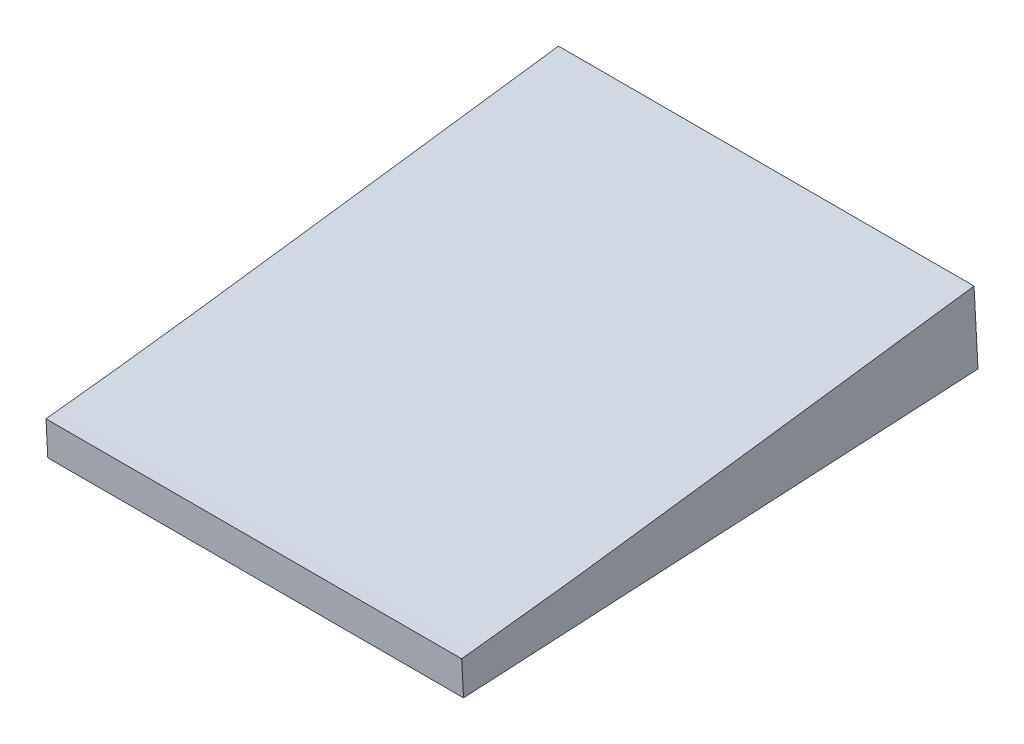
ISO-10303-21;
HEADER;
FILE_DESCRIPTION(('STEP AP214'),'2;1');
FILE_NAME('part.step','',(''),(''),'','','');
FILE_SCHEMA(('AUTOMOTIVE_DESIGN { 1 0 10303 214 1 1 1 1 }'));
ENDSEC;
DATA;
#1=APPLICATION_CONTEXT('core data for automotive mechanical design processes');
#2=APPLICATION_PROTOCOL_DEFINITION('international standard','automotive_design',2000,#1);
#3=PRODUCT_CONTEXT('',#1,'mechanical');
#4=PRODUCT('Part','Part','',(#3));
#5=PRODUCT_RELATED_PRODUCT_CATEGORY('part','',(#4));
#6=PRODUCT_DEFINITION_FORMATION('','',#4);
#7=PRODUCT_DEFINITION_CONTEXT('part definition',#1,'design');
#8=PRODUCT_DEFINITION('design','',#6,#7);
#9=PRODUCT_DEFINITION_SHAPE('','',#8);
#10=(LENGTH_UNIT() NAMED_UNIT(*) SI_UNIT(.MILLI.,.METRE.));
#11=(NAMED_UNIT(*) PLANE_ANGLE_UNIT() SI_UNIT($,.RADIAN.));
#12=(NAMED_UNIT(*) SI_UNIT($,.STERADIAN.) SOLID_ANGLE_UNIT());
#13=UNCERTAINTY_MEASURE_WITH_UNIT(LENGTH_MEASURE(1.E-05),#10,'distance_accuracy_value','');
#14=(GEOMETRIC_REPRESENTATION_CONTEXT(3) GLOBAL_UNCERTAINTY_ASSIGNED_CONTEXT((#13)) GLOBAL_UNIT_ASSIGNED_CONTEXT((#10,
#11,#12)) REPRESENTATION_CONTEXT('',''));
#15=CARTESIAN_POINT('',(0.,0.,0.));
#16=DIRECTION('',(0.,0.,1.));
#17=DIRECTION('',(1.,0.,0.));
#18=AXIS2_PLACEMENT_3D('',#15,#16,#17);
#19=CARTESIAN_POINT('',(-177.805848873745,-43.688210722732,-115.550179040921));
#20=DIRECTION('',(-2.29475219963646E-07,0.0534934907984705,-0.998568198192863));
#21=DIRECTION('',(0.,0.99856819819289,0.053493490798472));
#22=AXIS2_PLACEMENT_3D('',#19,#20,#21);
#23=PLANE('',#22);
#24=CARTESIAN_POINT('',(-339.424320676004,-41.2286300415403,-115.418381689263));
#25=CARTESIAN_POINT('',(-312.486933896687,-41.2286599807383,-115.418389483438));
#26=CARTESIAN_POINT('',(-285.549547117365,-41.2286808422066,-115.418396791316));
#27=CARTESIAN_POINT('',(-231.674773558697,-41.2287044096837,-115.418410434483));
#28=CARTESIAN_POINT('',(-204.737386779351,-41.2287071156926,-115.41841676977));
#29=CARTESIAN_POINT('',(-177.8,-41.2287007439717,-115.418422618762));
#30=B_SPLINE_CURVE_WITH_KNOTS('',3,(#24,#25,#26,#27,#28,#29),.UNSPECIFIED.,.F.,.F.,(4,2,4),(0.,
80.8121603379917,161.624320676034),.UNSPECIFIED.);
#31=CARTESIAN_POINT('',(-338.453291853417,-41.2286313501884,-115.418381982514));
#32=VERTEX_POINT('',#31);
#33=CARTESIAN_POINT('',(-177.8,-41.2287007439717,-115.418422618762));
#34=VERTEX_POINT('',#33);
#35=EDGE_CURVE('E99',#32,#34,#30,.T.);
#36=ORIENTED_EDGE('',*,*,#35,.T.);
#37=DIRECTION('',(0.,-0.99856819819289,-0.053493490798472));
#38=VECTOR('',#37,1.);
#39=CARTESIAN_POINT('',(-177.8,6.04731605634461,-112.885837288814));
#40=LINE('',#39,#38);
#41=CARTESIAN_POINT('',(-177.8,-27.7854361643582,-114.698264347082));
#42=VERTEX_POINT('',#41);
#43=EDGE_CURVE('E102',#42,#34,#40,.T.);
#44=ORIENTED_EDGE('',*,*,#43,.F.);
#45=CARTESIAN_POINT('',(-177.8,-27.7854361642381,-114.698264347069));
#46=CARTESIAN_POINT('',(-231.674773558668,-27.7854374698395,-114.698252035584));
#47=CARTESIAN_POINT('',(-285.549547117336,-27.7854387754408,-114.698239724099));
#48=CARTESIAN_POINT('',(-339.424320676004,-27.7854400810422,-114.698227412614));
#49=B_SPLINE_CURVE_WITH_KNOTS('',3,(#45,#46,#47,#48),.UNSPECIFIED.,.F.,.F.,(4,4),(0.,
161.624320676009),.UNSPECIFIED.);
#50=CARTESIAN_POINT('',(-338.421323075372,-27.7854400567378,-114.698227641805));
#51=VERTEX_POINT('',#50);
#52=EDGE_CURVE('E47',#42,#51,#49,.T.);
#53=ORIENTED_EDGE('',*,*,#52,.T.);
#54=DIRECTION('',(0.0023746530409731,0.998565382766486,0.0534933394298316));
#55=VECTOR('',#54,1.);
#56=CARTESIAN_POINT('',(-338.458234976646,-43.3072641668652,-115.529734741914));
#57=LINE('',#56,#55);
#58=EDGE_CURVE('E11',#32,#51,#57,.T.);
#59=ORIENTED_EDGE('',*,*,#58,.F.);
#60=EDGE_LOOP('',(#36,#44,#53,#59));
#61=FACE_BOUND('',#60,.T.);
#62=ADVANCED_FACE('F42',(#61),#23,.F.);
#63=CARTESIAN_POINT('',(-177.805940246243,-33.0381702413849,-314.355519034823));
#64=DIRECTION('',(-2.29475219526301E-07,0.0534934907984705,-0.998568198192863));
#65=DIRECTION('',(0.,0.99856819819289,0.053493490798472));
#66=AXIS2_PLACEMENT_3D('',#63,#64,#65);
#67=PLANE('',#66);
#68=CARTESIAN_POINT('',(-339.4243660882,-30.5401987010888,-314.221665077456));
#69=CARTESIAN_POINT('',(-312.486971740172,-30.5402152320651,-314.221672153351));
#70=CARTESIAN_POINT('',(-285.549577392142,-30.5402267068268,-314.221678958384));
#71=CARTESIAN_POINT('',(-231.674788696076,-30.540239543921,-314.221692026726));
#72=CARTESIAN_POINT('',(-204.737394348038,-30.5402409062534,-314.221698290034));
#73=CARTESIAN_POINT('',(-177.8,-30.5402372123712,-314.22170428248));
#74=B_SPLINE_CURVE_WITH_KNOTS('',3,(#68,#69,#70,#71,#72,#73),.UNSPECIFIED.,.F.,.F.,(4,2,4),(0.,
80.8121830440984,161.624366088212),.UNSPECIFIED.);
#75=CARTESIAN_POINT('',(-338.453246242115,-30.5401994156522,-314.221665338883));
#76=VERTEX_POINT('',#75);
#77=CARTESIAN_POINT('',(-177.8,-30.5402372123712,-314.22170428248));
#78=VERTEX_POINT('',#77);
#79=EDGE_CURVE('E74',#76,#78,#74,.T.);
#80=ORIENTED_EDGE('',*,*,#79,.F.);
#81=DIRECTION('',(0.0023746530409731,0.998565382766486,0.0534933394298316));
#82=VECTOR('',#81,1.);
#83=CARTESIAN_POINT('',(-338.458280662959,-32.6572237938514,-314.335074741631));
#84=LINE('',#83,#82);
#85=CARTESIAN_POINT('',(-338.385473794122,-2.04120638245379,-312.694968806027));
#86=VERTEX_POINT('',#85);
#87=EDGE_CURVE('E100',#76,#86,#84,.T.);
#88=ORIENTED_EDGE('',*,*,#87,.T.);
#89=CARTESIAN_POINT('',(-177.8,-2.04120156395444,-312.695005454346));
#90=CARTESIAN_POINT('',(-231.674788696067,-2.041203180511,-312.694993159211));
#91=CARTESIAN_POINT('',(-285.549577392133,-2.04120479706756,-312.694980864076));
#92=CARTESIAN_POINT('',(-339.4243660882,-2.04120641362412,-312.694968568941));
#93=B_SPLINE_CURVE_WITH_KNOTS('',3,(#89,#90,#91,#92),.UNSPECIFIED.,.F.,.F.,(4,4),(0.,
161.624366088204),.UNSPECIFIED.);
#94=CARTESIAN_POINT('',(-177.8,-2.0412015642015,-312.695005454378));
#95=VERTEX_POINT('',#94);
#96=EDGE_CURVE('E66',#95,#86,#93,.T.);
#97=ORIENTED_EDGE('',*,*,#96,.F.);
#98=DIRECTION('',(0.,-0.99856819819289,-0.053493490798472));
#99=VECTOR('',#98,1.);
#100=CARTESIAN_POINT('',(-177.8,16.697356429359,-311.691177288541));
#101=LINE('',#100,#99);
#102=EDGE_CURVE('E107',#95,#78,#101,.T.);
#103=ORIENTED_EDGE('',*,*,#102,.T.);
#104=EDGE_LOOP('',(#80,#88,#97,#103));
#105=FACE_BOUND('',#104,.T.);
#106=ADVANCED_FACE('F157',(#105),#67,.T.);
#107=CARTESIAN_POINT('',(-338.458280662959,-32.6572237938514,-314.335074741631));
#108=DIRECTION('',(-0.999997180507466,0.0023712407330619,0.000127257626607295));
#109=DIRECTION('',(-0.00237124075226243,-0.999997188604695,0.));
#110=AXIS2_PLACEMENT_3D('',#107,#108,#109);
#111=PLANE('',#110);
#112=CARTESIAN_POINT('',(-338.453292687718,-41.4241402998049,-111.781943848078));
#113=CARTESIAN_POINT('',(-338.453277104788,-37.7724773870629,-179.70234426699));
#114=CARTESIAN_POINT('',(-338.453261521857,-34.1208144743209,-247.622744685901));
#115=CARTESIAN_POINT('',(-338.453245938927,-30.469151561579,-315.543145104813));
#116=B_SPLINE_CURVE_WITH_KNOTS('',3,(#112,#113,#114,#115),.UNSPECIFIED.,.F.,.F.,(4,4),(0.,
204.055479994644),.UNSPECIFIED.);
#117=EDGE_CURVE('E106',#32,#76,#116,.T.);
#118=ORIENTED_EDGE('',*,*,#117,.F.);
#119=ORIENTED_EDGE('',*,*,#58,.T.);
#120=CARTESIAN_POINT('',(-338.384947441491,-1.66638011947957,-315.543145104813));
#121=CARTESIAN_POINT('',(-338.385078563461,-1.75963757033328,-314.835806230373));
#122=CARTESIAN_POINT('',(-338.385209250782,-1.85271300648972,-314.128443420129));
#123=CARTESIAN_POINT('',(-338.385470367223,-2.03875575841565,-312.713703481737));
#124=CARTESIAN_POINT('',(-338.385600796342,-2.13172307417116,-312.006326353586));
#125=CARTESIAN_POINT('',(-338.385862007422,-2.3178054581883,-310.591591608237));
#126=CARTESIAN_POINT('',(-338.385992789381,-2.41092052643067,-309.884233991036));
#127=CARTESIAN_POINT('',(-338.386255215013,-2.59751150681119,-308.469566388183));
#128=CARTESIAN_POINT('',(-338.386386858684,-2.69098741892434,-307.762256402527));
#129=CARTESIAN_POINT('',(-338.386650876671,-2.87824516985871,-306.347677416689));
#130=CARTESIAN_POINT('',(-338.386783250986,-2.97202700847756,-305.64040841648));
#131=CARTESIAN_POINT('',(-338.387048665371,-3.15986946259663,-304.225907407066));
#132=CARTESIAN_POINT('',(-338.387181705442,-3.25393007810986,-303.518675397862));
#133=CARTESIAN_POINT('',(-338.387581697856,-3.53647713634071,-301.39702803848));
#134=CARTESIAN_POINT('',(-338.387849522406,-3.7253287950901,-299.982661323765));
#135=CARTESIAN_POINT('',(-338.388386881024,-4.1037469056632,-297.15404237198));
#136=CARTESIAN_POINT('',(-338.388656415071,-4.29331334812752,-295.739790133656));
#137=CARTESIAN_POINT('',(-338.389196491617,-4.67286847586112,-292.911342318118));
#138=CARTESIAN_POINT('',(-338.389467034116,-4.86285716113694,-291.497146740906));
#139=CARTESIAN_POINT('',(-338.390008809956,-5.2431238029318,-288.668794146179));
#140=CARTESIAN_POINT('',(-338.390280043296,-5.43340175951744,-287.254637128672));
#141=CARTESIAN_POINT('',(-338.390823344902,-5.8143072482647,-284.42637019891));
#142=CARTESIAN_POINT('',(-338.391095413167,-6.00493478042056,-283.012260286654));
#143=CARTESIAN_POINT('',(-338.391912979578,-6.5773859396157,-278.770035957681));
#144=CARTESIAN_POINT('',(-338.392459844743,-6.95978192100255,-275.94199873558));
#145=CARTESIAN_POINT('',(-338.393557593861,-7.72625642597304,-270.286152693634));
#146=CARTESIAN_POINT('',(-338.394108477815,-8.11033494936245,-267.458343873762));
#147=CARTESIAN_POINT('',(-338.395212992249,-8.87964046162332,-261.802908783977));
#148=CARTESIAN_POINT('',(-338.395766622704,-9.26486743999917,-258.975282512637));
#149=CARTESIAN_POINT('',(-338.39687553348,-10.0360121279861,-253.320124034228));
#150=CARTESIAN_POINT('',(-338.3974308138,-10.4219298376351,-250.492591827166));
#151=CARTESIAN_POINT('',(-338.398541874375,-11.1939730891917,-244.837583301825));
#152=CARTESIAN_POINT('',(-338.399097654625,-11.5800986290797,-242.010106983271));
#153=CARTESIAN_POINT('',(-338.400208582343,-12.3520847920908,-236.355118210172));
#154=CARTESIAN_POINT('',(-338.400763729811,-12.7379454152181,-233.527605755627));
#155=CARTESIAN_POINT('',(-338.401872048431,-13.5088376956471,-227.872497300756));
#156=CARTESIAN_POINT('',(-338.402425219605,-13.8938693614024,-225.044901301582));
#157=CARTESIAN_POINT('',(-338.403528262364,-14.6625512779186,-219.389521413539));
#158=CARTESIAN_POINT('',(-338.40407813395,-15.0462015286648,-216.561737524667));
#159=CARTESIAN_POINT('',(-338.405173264434,-15.8115786127917,-210.905762784127));
#160=CARTESIAN_POINT('',(-338.405718523096,-16.1933053472859,-208.07757191907));
#161=CARTESIAN_POINT('',(-338.406803097703,-16.9542706341982,-202.420855270575));
#162=CARTESIAN_POINT('',(-338.407342413649,-17.3335091866207,-199.592329487137));
#163=CARTESIAN_POINT('',(-338.40841320511,-18.0887016821352,-193.934870804958));
#164=CARTESIAN_POINT('',(-338.408944680712,-18.4646556612982,-191.105937911034));
#165=CARTESIAN_POINT('',(-338.409997858857,-19.2124711879498,-185.447530776499));
#166=CARTESIAN_POINT('',(-338.410519561399,-19.5843327353214,-182.618056535871));
#167=CARTESIAN_POINT('',(-338.411551240678,-20.3231435784671,-176.958497932764));
#168=CARTESIAN_POINT('',(-338.412061217543,-20.6900929281017,-174.128413577322));
#169=CARTESIAN_POINT('',(-338.413067582981,-21.4183004966397,-168.467512402178));
#170=CARTESIAN_POINT('',(-338.413563971555,-21.7795587160408,-165.63669558254));
#171=CARTESIAN_POINT('',(-338.414540658199,-22.4953353830681,-159.974206673273));
#172=CARTESIAN_POINT('',(-338.415020956253,-22.8498538250268,-157.142534582927));
#173=CARTESIAN_POINT('',(-338.415962801398,-23.5510353741845,-151.478215826155));
#174=CARTESIAN_POINT('',(-338.416424348481,-23.8976984783174,-148.64556915935));
#175=CARTESIAN_POINT('',(-338.417326052974,-24.5820676026304,-142.979095470675));
#176=CARTESIAN_POINT('',(-338.41776620966,-24.9197733189908,-140.145268412069));
#177=CARTESIAN_POINT('',(-338.41862258255,-25.585151645236,-134.476439483816));
#178=CARTESIAN_POINT('',(-338.419038798787,-25.912824269082,-131.641437615807));
#179=CARTESIAN_POINT('',(-338.419844049086,-26.5567906864522,-125.969861066777));
#180=CARTESIAN_POINT('',(-338.420233080515,-26.8730833761396,-123.133286260133));
#181=CARTESIAN_POINT('',(-338.420980269604,-27.4927252701061,-117.458709927419));
#182=CARTESIAN_POINT('',(-338.421338427109,-27.7960744089563,-114.62070839421));
#183=CARTESIAN_POINT('',(-338.421679321969,-28.0921845117294,-111.781943848078));
#184=B_SPLINE_CURVE_WITH_KNOTS('',3,(#120,#121,#122,#123,#124,#125,#126,#127,#128,#129,#130,
#131,#132,#133,#134,#135,#136,#137,#138,#139,#140,#141,#142,#143,#144,#145,#146,#147,#148,#149,
#150,#151,#152,#153,#154,#155,#156,#157,#158,#159,#160,#161,#162,#163,#164,#165,#166,#167,#168,
#169,#170,#171,#172,#173,#174,#175,#176,#177,#178,#179,#180,#181,#182,#183),.UNSPECIFIED.,.F.,
.F.,(4,2,2,2,2,2,2,2,2,2,2,2,2,2,2,2,2,2,2,2,2,2,2,2,2,2,2,2,2,2,2,4),(0.,2.14038007487454,
4.28076042653164,6.42114049919354,8.5615204235638,10.7018989323324,12.8422775410499,
17.1230346593276,21.4037359186347,25.6844372442147,29.9651395555147,34.2458417963986,
42.8071608777192,51.3684789707217,59.9297190610428,68.4909596218779,77.0521184405876,
85.613277119377,94.1743480743276,102.73541911965,111.296925882802,119.858432631171,
128.419845239388,136.981258092505,145.542576995954,154.103895150897,162.665220504814,
171.226549200314,179.788167911635,188.349774708823,196.91220974255,205.474688053845),.UNSPECIFIED.);
#185=EDGE_CURVE('E97',#86,#51,#184,.T.);
#186=ORIENTED_EDGE('',*,*,#185,.F.);
#187=ORIENTED_EDGE('',*,*,#87,.F.);
#188=EDGE_LOOP('',(#118,#119,#186,#187));
#189=FACE_BOUND('',#188,.T.);
#190=ADVANCED_FACE('F44',(#189),#111,.T.);
#191=CARTESIAN_POINT('',(-177.8,0.,0.));
#192=DIRECTION('',(-1.,0.,0.));
#193=DIRECTION('',(0.,0.,1.));
#194=AXIS2_PLACEMENT_3D('',#191,#192,#193);
#195=PLANE('',#194);
#196=CARTESIAN_POINT('',(-177.8,-6.51913907058263,69.5663617744474));
#197=CARTESIAN_POINT('',(-177.8,-6.88721273253516,69.4883910827677));
#198=CARTESIAN_POINT('',(-177.8,-7.61052758633523,69.3363760132391));
#199=CARTESIAN_POINT('',(-177.8,-8.76184326811464,69.0354225894495));
#200=CARTESIAN_POINT('',(-177.8,-9.88259406782119,68.626070203946));
#201=CARTESIAN_POINT('',(-177.8,-12.021228930256,67.6619851025588));
#202=CARTESIAN_POINT('',(-177.8,-14.9546020256939,65.6923130131807));
#203=CARTESIAN_POINT('',(-177.8,-18.1374494761777,62.3412188200519));
#204=CARTESIAN_POINT('',(-177.8,-21.5964876349103,57.3382189268778));
#205=CARTESIAN_POINT('',(-177.8,-24.7903629698325,50.5220499235312));
#206=CARTESIAN_POINT('',(-177.8,-27.5359775514862,42.0059138994073));
#207=CARTESIAN_POINT('',(-177.8,-29.5513425657538,33.3240400078997));
#208=CARTESIAN_POINT('',(-177.8,-31.532992144648,21.6352015564033));
#209=CARTESIAN_POINT('',(-177.8,-33.0186008410447,6.91344102508237));
#210=CARTESIAN_POINT('',(-177.8,-33.7765423596692,-10.7972873340441));
#211=CARTESIAN_POINT('',(-177.8,-33.7950491418743,-28.5097311954228));
#212=CARTESIAN_POINT('',(-177.8,-33.2586088383385,-46.2043865238911));
#213=CARTESIAN_POINT('',(-177.8,-31.9669194489648,-69.7641945581866));
#214=CARTESIAN_POINT('',(-177.8,-29.5034076215053,-99.1460197389462));
#215=CARTESIAN_POINT('',(-177.8,-25.6933715620582,-134.308212307564));
#216=CARTESIAN_POINT('',(-177.8,-21.3490549530988,-169.399514794737));
#217=CARTESIAN_POINT('',(-177.8,-16.7038848255612,-204.446464420127));
#218=CARTESIAN_POINT('',(-177.8,-11.9288122826792,-239.471434511741));
#219=CARTESIAN_POINT('',(-177.8,-7.93942067939684,-268.654643904962));
#220=CARTESIAN_POINT('',(-177.8,-4.79172290140647,-292.007732636027));
#221=CARTESIAN_POINT('',(-177.8,-2.83780100098235,-306.600292672818));
#222=CARTESIAN_POINT('',(-177.8,-1.30907436693598,-318.288997719976));
#223=CARTESIAN_POINT('',(-177.8,0.263068831943658,-329.949567815073));
#224=CARTESIAN_POINT('',(-177.8,1.719295513011,-344.570295270056));
#225=CARTESIAN_POINT('',(-177.8,2.80506666571039,-362.175990442094));
#226=CARTESIAN_POINT('',(-177.8,3.31793184017618,-385.687405296962));
#227=CARTESIAN_POINT('',(-177.8,2.25388387982141,-415.082460117617));
#228=CARTESIAN_POINT('',(-177.8,-0.960221939673565,-444.321872591633));
#229=CARTESIAN_POINT('',(-177.8,-4.72777257870521,-467.542126740326));
#230=CARTESIAN_POINT('',(-177.8,-6.96557190432381,-479.089279042028));
#231=CARTESIAN_POINT('',(-177.8,-8.1921973731203,-484.839703055914));
#232=B_SPLINE_CURVE_WITH_KNOTS('',3,(#196,#197,#198,#199,#200,#201,#202,#203,#204,#205,#206,
#207,#208,#209,#210,#211,#212,#213,#214,#215,#216,#217,#218,#219,#220,#221,#222,#223,#224,#225,
#226,#227,#228,#229,#230,#231),.UNSPECIFIED.,.F.,.F.,(4,1,1,1,1,1,1,1,1,1,1,1,1,1,1,1,1,1,1,1,1,
1,1,1,1,1,1,1,1,1,1,1,1,4),(-6.87555594952044E-05,0.00188450372870693,0.00383776301690907,
0.00579102230511121,0.00774428159331335,0.0155573187461219,0.0233703558989304,0.031183393051739,
0.0468094673573561,0.0624355416629732,0.0780616159685904,0.0936876902742075,0.124939838885442,
0.156191987496676,0.18744413610791,0.218696284719144,0.249948433330378,0.312452730552847,
0.374957027775315,0.437461324997784,0.499965622220252,0.562469919442721,0.624974216665189,
0.656226365276424,0.687478513887658,0.703104588193275,0.718730662498892,0.749982811110126,
0.78123495972136,0.812487108332595,0.874991405555063,0.937495702777532,0.968747851388766,1.),.UNSPECIFIED.);
#233=EDGE_CURVE('E58',#42,#95,#232,.T.);
#234=ORIENTED_EDGE('',*,*,#233,.F.);
#235=ORIENTED_EDGE('',*,*,#43,.T.);
#236=DIRECTION('',(0.,-0.0536864833252265,0.998557840842567));
#237=VECTOR('',#236,1.);
#238=CARTESIAN_POINT('',(-177.8,-19.8517756392125,-513.024949519574));
#239=LINE('',#238,#237);
#240=EDGE_CURVE('E111',#78,#34,#239,.T.);
#241=ORIENTED_EDGE('',*,*,#240,.F.);
#242=ORIENTED_EDGE('',*,*,#102,.F.);
#243=EDGE_LOOP('',(#234,#235,#241,#242));
#244=FACE_BOUND('',#243,.T.);
#245=ADVANCED_FACE('F109',(#244),#195,.F.);
#246=DIRECTION('',(-1.,0.,0.));
#247=VECTOR('',#246,1.);
#248=SURFACE_OF_LINEAR_EXTRUSION('',#232,#247);
#249=ORIENTED_EDGE('',*,*,#96,.T.);
#250=ORIENTED_EDGE('',*,*,#185,.T.);
#251=ORIENTED_EDGE('',*,*,#52,.F.);
#252=ORIENTED_EDGE('',*,*,#233,.T.);
#253=EDGE_LOOP('',(#249,#250,#251,#252));
#254=FACE_BOUND('',#253,.T.);
#255=ADVANCED_FACE('F95',(#254),#248,.T.);
#256=CARTESIAN_POINT('',(-177.8,-19.8517756392125,-513.024949519574));
#257=CARTESIAN_POINT('',(-230.927822670913,-19.8517756392131,-513.024949519573));
#258=CARTESIAN_POINT('',(-327.221843777014,-19.85177556461,-513.024949512121));
#259=CARTESIAN_POINT('',(-429.163295145268,-19.851747405451,-513.02494669903));
#260=CARTESIAN_POINT('',(-478.37373551928,-19.8553917991521,-513.025310773422));
#261=CARTESIAN_POINT('',(-484.526566689,-19.8509810482507,-513.024870140049));
#262=CARTESIAN_POINT('',(-485.325724035843,-19.8616136905836,-513.025932339458));
#263=CARTESIAN_POINT('',(-485.74220278189,-19.8504556461254,-513.024817652453));
#264=CARTESIAN_POINT('',(-486.055073478805,-19.837998853289,-513.023573220676));
#265=CARTESIAN_POINT('',(-486.721023025963,-19.7896920332219,-513.018747376438));
#266=CARTESIAN_POINT('',(-488.005895224868,-19.7156619716598,-513.011351784149));
#267=CARTESIAN_POINT('',(-489.990982303435,-19.5950176463225,-512.999299433747));
#268=CARTESIAN_POINT('',(-493.418075753209,-19.3845673435656,-512.978275479375));
#269=CARTESIAN_POINT('',(-496.275498294021,-19.2098686829378,-512.960823108809));
#270=CARTESIAN_POINT('',(-498.171448850375,-19.093967149797,-512.949244562662));
#271=CARTESIAN_POINT('',(-177.8,-30.0585978788049,-323.180099453892));
#272=CARTESIAN_POINT('',(-230.855154718641,-30.058770737324,-323.176884320058));
#273=CARTESIAN_POINT('',(-327.016912296079,-30.0590839881502,-323.17105699538));
#274=CARTESIAN_POINT('',(-429.020294549715,-30.0592878861405,-323.164847100743));
#275=CARTESIAN_POINT('',(-478.353129811688,-30.0588050980014,-323.162018312611));
#276=CARTESIAN_POINT('',(-484.523199500304,-30.0600534699108,-323.161427333636));
#277=CARTESIAN_POINT('',(-485.324580302747,-30.0690959154497,-323.162123856821));
#278=CARTESIAN_POINT('',(-485.74206530166,-30.058202792822,-323.161289082879));
#279=CARTESIAN_POINT('',(-486.056022391488,-30.0459749246713,-323.160365123254));
#280=CARTESIAN_POINT('',(-486.726854468382,-29.9977980837545,-323.15680071936));
#281=CARTESIAN_POINT('',(-488.035171334072,-29.9232183577818,-323.151304954233));
#282=CARTESIAN_POINT('',(-490.096684748401,-29.8002690608145,-323.142321356302));
#283=CARTESIAN_POINT('',(-493.765994874844,-29.5795426148951,-323.126513034935));
#284=CARTESIAN_POINT('',(-496.972926582145,-29.3872285713691,-323.113188483415));
#285=CARTESIAN_POINT('',(-499.062687476354,-29.2618726277478,-323.104398152242));
#286=CARTESIAN_POINT('',(-177.8,-40.2654201183974,-133.335249388211));
#287=CARTESIAN_POINT('',(-230.78248676637,-40.2657658354349,-133.328819120543));
#288=CARTESIAN_POINT('',(-326.811980815146,-40.2663924116903,-133.317164478639));
#289=CARTESIAN_POINT('',(-428.877293954164,-40.26682836683,-133.304747502456));
#290=CARTESIAN_POINT('',(-478.332524104096,-40.2622183968507,-133.298725851801));
#291=CARTESIAN_POINT('',(-484.519832311607,-40.2691258915708,-133.297984527223));
#292=CARTESIAN_POINT('',(-485.323436569652,-40.2765781403158,-133.298315374185));
#293=CARTESIAN_POINT('',(-485.741927821432,-40.2659499395185,-133.297760513305));
#294=CARTESIAN_POINT('',(-486.056971304171,-40.2539509960537,-133.297157025832));
#295=CARTESIAN_POINT('',(-486.732685910802,-40.205904134287,-133.294854062282));
#296=CARTESIAN_POINT('',(-488.064447443276,-40.1307747439037,-133.291258124317));
#297=CARTESIAN_POINT('',(-490.202387193366,-40.0055204753064,-133.285343278857));
#298=CARTESIAN_POINT('',(-494.11391399648,-39.7745178862246,-133.274750590496));
#299=CARTESIAN_POINT('',(-497.670354870269,-39.5645884598005,-133.265553858022));
#300=CARTESIAN_POINT('',(-499.953926102333,-39.4297781056986,-133.259551741823));
#301=CARTESIAN_POINT('',(-177.8,-50.4722423579898,56.5096006774697));
#302=CARTESIAN_POINT('',(-230.709818814098,-50.4727609335458,56.5192460789722));
#303=CARTESIAN_POINT('',(-326.607049334211,-50.4737008352305,56.5367280381017));
#304=CARTESIAN_POINT('',(-428.734293358612,-50.4743688475195,56.5553520958316));
#305=CARTESIAN_POINT('',(-478.311918396505,-50.4656316957,56.5645666090093));
#306=CARTESIAN_POINT('',(-484.51646512291,-50.4781983132309,56.5654582791896));
#307=CARTESIAN_POINT('',(-485.322292836556,-50.4840603651819,56.565493108451));
#308=CARTESIAN_POINT('',(-485.741790341202,-50.4736970862151,56.5657680562688));
#309=CARTESIAN_POINT('',(-486.057920216853,-50.461927067436,56.5660510715899));
#310=CARTESIAN_POINT('',(-486.738517353221,-50.4140101848196,56.5670925947966));
#311=CARTESIAN_POINT('',(-488.09372355248,-50.3383311300257,56.5687887055985));
#312=CARTESIAN_POINT('',(-490.308089638331,-50.2107718897984,56.5716347985879));
#313=CARTESIAN_POINT('',(-494.461833118115,-49.969493157554,56.5770118539443));
#314=CARTESIAN_POINT('',(-498.367783158393,-49.7419483482318,56.5820807673716));
#315=CARTESIAN_POINT('',(-500.845164728312,-49.5976835836494,56.5852946685971));
#316=B_SPLINE_SURFACE_WITH_KNOTS('',3,3,((#256,#257,#258,#259,#260,#261,#262,#263,#264,#265,
#266,#267,#268,#269,#270),(#271,#272,#273,#274,#275,#276,#277,#278,#279,#280,#281,#282,#283,
#284,#285),(#286,#287,#288,#289,#290,#291,#292,#293,#294,#295,#296,#297,#298,#299,#300),(#301,
#302,#303,#304,#305,#306,#307,#308,#309,#310,#311,#312,#313,#314,#315)),.UNSPECIFIED.,.F.,.F.,
.F.,(4,4),(4,1,1,1,1,1,1,1,1,1,1,1,4),(0.,1.),(0.,0.5,0.90625,0.95703125,0.9609375,0.9638671875,
0.96450845898134,0.96484375,0.966796875,0.970703125,0.9765625,0.984375,1.),.UNSPECIFIED.);
#317=ORIENTED_EDGE('',*,*,#35,.F.);
#318=ORIENTED_EDGE('',*,*,#117,.T.);
#319=ORIENTED_EDGE('',*,*,#79,.T.);
#320=ORIENTED_EDGE('',*,*,#240,.T.);
#321=EDGE_LOOP('',(#317,#318,#319,#320));
#322=FACE_BOUND('',#321,.T.);
#323=ADVANCED_FACE('F134',(#322),#316,.T.);
#324=CLOSED_SHELL('',(#62,#106,#190,#245,#255,#323));
#325=MANIFOLD_SOLID_BREP('B2',#324);
#326=ADVANCED_BREP_SHAPE_REPRESENTATION('',(#18,#325),#14);
#327=SHAPE_DEFINITION_REPRESENTATION(#9,#326);
ENDSEC;
END-ISO-10303-21;
